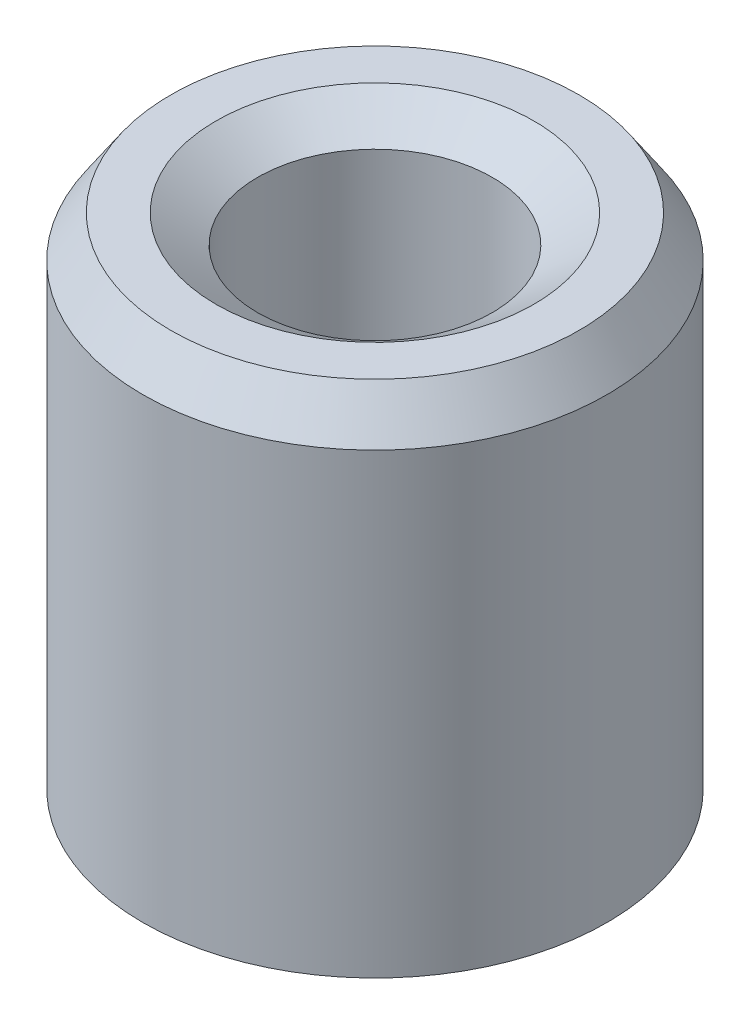
ISO-10303-21;
HEADER;
FILE_DESCRIPTION(('STEP AP214'),'2;1');
FILE_NAME('part.step','',(''),(''),'','','');
FILE_SCHEMA(('AUTOMOTIVE_DESIGN { 1 0 10303 214 1 1 1 1 }'));
ENDSEC;
DATA;
#1=APPLICATION_CONTEXT('core data for automotive mechanical design processes');
#2=APPLICATION_PROTOCOL_DEFINITION('international standard','automotive_design',2000,#1);
#3=PRODUCT_CONTEXT('',#1,'mechanical');
#4=PRODUCT('Part','Part','',(#3));
#5=PRODUCT_RELATED_PRODUCT_CATEGORY('part','',(#4));
#6=PRODUCT_DEFINITION_FORMATION('','',#4);
#7=PRODUCT_DEFINITION_CONTEXT('part definition',#1,'design');
#8=PRODUCT_DEFINITION('design','',#6,#7);
#9=PRODUCT_DEFINITION_SHAPE('','',#8);
#10=(LENGTH_UNIT() NAMED_UNIT(*) SI_UNIT(.MILLI.,.METRE.));
#11=(NAMED_UNIT(*) PLANE_ANGLE_UNIT() SI_UNIT($,.RADIAN.));
#12=(NAMED_UNIT(*) SI_UNIT($,.STERADIAN.) SOLID_ANGLE_UNIT());
#13=UNCERTAINTY_MEASURE_WITH_UNIT(LENGTH_MEASURE(1.E-05),#10,'distance_accuracy_value','');
#14=(GEOMETRIC_REPRESENTATION_CONTEXT(3) GLOBAL_UNCERTAINTY_ASSIGNED_CONTEXT((#13)) GLOBAL_UNIT_ASSIGNED_CONTEXT((#10,
#11,#12)) REPRESENTATION_CONTEXT('',''));
#15=CARTESIAN_POINT('',(0.,0.,0.));
#16=DIRECTION('',(0.,0.,1.));
#17=DIRECTION('',(1.,0.,0.));
#18=AXIS2_PLACEMENT_3D('',#15,#16,#17);
#19=CARTESIAN_POINT('',(0.,11.3471455715994,0.));
#20=DIRECTION('',(0.,-1.,0.));
#21=DIRECTION('',(0.,0.,-1.));
#22=AXIS2_PLACEMENT_3D('',#19,#20,#21);
#23=CYLINDRICAL_SURFACE('',#22,5.);
#24=CARTESIAN_POINT('',(0.,0.603669940585937,0.));
#25=DIRECTION('',(0.,1.,0.));
#26=DIRECTION('',(0.,0.,1.));
#27=AXIS2_PLACEMENT_3D('',#24,#25,#26);
#28=CIRCLE('',#27,5.);
#29=CARTESIAN_POINT('',(0.,0.603669940585937,5.));
#30=VERTEX_POINT('',#29);
#31=EDGE_CURVE('E10',#30,#30,#28,.T.);
#32=ORIENTED_EDGE('',*,*,#31,.T.);
#33=EDGE_LOOP('',(#32));
#34=FACE_BOUND('',#33,.T.);
#35=CARTESIAN_POINT('',(0.,10.451034548638,0.));
#36=DIRECTION('',(0.,1.,0.));
#37=DIRECTION('',(0.,0.,1.));
#38=AXIS2_PLACEMENT_3D('',#35,#36,#37);
#39=CIRCLE('',#38,5.);
#40=CARTESIAN_POINT('',(0.,10.451034548638,5.));
#41=VERTEX_POINT('',#40);
#42=EDGE_CURVE('E50',#41,#41,#39,.F.);
#43=ORIENTED_EDGE('',*,*,#42,.T.);
#44=EDGE_LOOP('',(#43));
#45=FACE_BOUND('',#44,.T.);
#46=ADVANCED_FACE('F39',(#34,#45),#23,.T.);
#47=CARTESIAN_POINT('',(0.,11.3471455715994,0.));
#48=DIRECTION('',(0.,1.,0.));
#49=DIRECTION('',(0.,0.,1.));
#50=AXIS2_PLACEMENT_3D('',#47,#48,#49);
#51=PLANE('',#50);
#52=CARTESIAN_POINT('',(0.,11.3471455715994,0.));
#53=DIRECTION('',(0.,1.,0.));
#54=DIRECTION('',(0.,0.,1.));
#55=AXIS2_PLACEMENT_3D('',#52,#53,#54);
#56=CIRCLE('',#55,3.42314823379089);
#57=CARTESIAN_POINT('',(0.,11.3471455715994,3.42314823379089));
#58=VERTEX_POINT('',#57);
#59=EDGE_CURVE('E58',#58,#58,#56,.F.);
#60=ORIENTED_EDGE('',*,*,#59,.T.);
#61=EDGE_LOOP('',(#60));
#62=FACE_BOUND('',#61,.T.);
#63=CARTESIAN_POINT('',(0.,11.3471455715994,0.));
#64=DIRECTION('',(0.,1.,0.));
#65=DIRECTION('',(0.,0.,1.));
#66=AXIS2_PLACEMENT_3D('',#63,#64,#65);
#67=CIRCLE('',#66,4.39633005941406);
#68=CARTESIAN_POINT('',(0.,11.3471455715994,4.39633005941406));
#69=VERTEX_POINT('',#68);
#70=EDGE_CURVE('E61',#69,#69,#67,.T.);
#71=ORIENTED_EDGE('',*,*,#70,.T.);
#72=EDGE_LOOP('',(#71));
#73=FACE_BOUND('',#72,.T.);
#74=ADVANCED_FACE('F88',(#62,#73),#51,.T.);
#75=CARTESIAN_POINT('',(0.,0.,0.));
#76=DIRECTION('',(0.,1.,0.));
#77=DIRECTION('',(0.,0.,1.));
#78=AXIS2_PLACEMENT_3D('',#75,#76,#77);
#79=PLANE('',#78);
#80=CARTESIAN_POINT('',(0.,0.,0.));
#81=DIRECTION('',(0.,1.,0.));
#82=DIRECTION('',(0.,0.,1.));
#83=AXIS2_PLACEMENT_3D('',#80,#81,#82);
#84=CIRCLE('',#83,3.13070715141538);
#85=CARTESIAN_POINT('',(0.,0.,3.13070715141538));
#86=VERTEX_POINT('',#85);
#87=EDGE_CURVE('E51',#86,#86,#84,.T.);
#88=ORIENTED_EDGE('',*,*,#87,.T.);
#89=EDGE_LOOP('',(#88));
#90=FACE_BOUND('',#89,.T.);
#91=CARTESIAN_POINT('',(0.,0.,0.));
#92=DIRECTION('',(0.,1.,0.));
#93=DIRECTION('',(0.,0.,1.));
#94=AXIS2_PLACEMENT_3D('',#91,#92,#93);
#95=CIRCLE('',#94,4.10388897703856);
#96=CARTESIAN_POINT('',(0.,0.,4.10388897703856));
#97=VERTEX_POINT('',#96);
#98=EDGE_CURVE('E54',#97,#97,#95,.F.);
#99=ORIENTED_EDGE('',*,*,#98,.T.);
#100=EDGE_LOOP('',(#99));
#101=FACE_BOUND('',#100,.T.);
#102=ADVANCED_FACE('F83',(#90,#101),#79,.F.);
#103=CARTESIAN_POINT('',(0.,11.3471455715994,0.));
#104=DIRECTION('',(0.,-1.,0.));
#105=DIRECTION('',(0.,0.,-1.));
#106=AXIS2_PLACEMENT_3D('',#103,#104,#105);
#107=CYLINDRICAL_SURFACE('',#106,2.52703721082945);
#108=CARTESIAN_POINT('',(0.,10.7434756310135,0.));
#109=DIRECTION('',(0.,1.,0.));
#110=DIRECTION('',(0.,0.,1.));
#111=AXIS2_PLACEMENT_3D('',#108,#109,#110);
#112=CIRCLE('',#111,2.52703721082945);
#113=CARTESIAN_POINT('',(0.,10.7434756310135,2.52703721082944));
#114=VERTEX_POINT('',#113);
#115=EDGE_CURVE('E67',#114,#114,#112,.T.);
#116=ORIENTED_EDGE('',*,*,#115,.T.);
#117=EDGE_LOOP('',(#116));
#118=FACE_BOUND('',#117,.T.);
#119=CARTESIAN_POINT('',(0.,0.896111022961436,0.));
#120=DIRECTION('',(0.,1.,0.));
#121=DIRECTION('',(0.,0.,1.));
#122=AXIS2_PLACEMENT_3D('',#119,#120,#121);
#123=CIRCLE('',#122,2.52703721082945);
#124=CARTESIAN_POINT('',(0.,0.896111022961436,2.52703721082945));
#125=VERTEX_POINT('',#124);
#126=EDGE_CURVE('E69',#125,#125,#123,.F.);
#127=ORIENTED_EDGE('',*,*,#126,.T.);
#128=EDGE_LOOP('',(#127));
#129=FACE_BOUND('',#128,.T.);
#130=ADVANCED_FACE('F71',(#118,#129),#107,.F.);
#131=CARTESIAN_POINT('',(0.,10.7434756310135,0.));
#132=DIRECTION('',(0.,1.,0.));
#133=DIRECTION('',(0.,0.,1.));
#134=AXIS2_PLACEMENT_3D('',#131,#132,#133);
#135=CONICAL_SURFACE('',#134,2.52703721082945,0.977971031399739);
#136=CARTESIAN_POINT('',(0.,11.3471455715994,3.42314823379089));
#137=CARTESIAN_POINT('',(0.,11.3408573430516,3.41381374396838));
#138=CARTESIAN_POINT('',(0.,11.3345691145039,3.40447925414586));
#139=CARTESIAN_POINT('',(0.,11.3219926574083,3.38581027450083));
#140=CARTESIAN_POINT('',(0.,11.3157044288606,3.37647578467832));
#141=CARTESIAN_POINT('',(0.,11.303127971765,3.35780680503329));
#142=CARTESIAN_POINT('',(0.,11.2968397432172,3.34847231521077));
#143=CARTESIAN_POINT('',(0.,11.2842632861217,3.32980333556574));
#144=CARTESIAN_POINT('',(0.,11.2779750575739,3.32046884574323));
#145=CARTESIAN_POINT('',(0.,11.2653986004784,3.3017998660982));
#146=CARTESIAN_POINT('',(0.,11.2591103719306,3.29246537627568));
#147=CARTESIAN_POINT('',(0.,11.2465339148351,3.27379639663065));
#148=CARTESIAN_POINT('',(0.,11.2402456862873,3.26446190680813));
#149=CARTESIAN_POINT('',(0.,11.2276692291918,3.2457929271631));
#150=CARTESIAN_POINT('',(0.,11.221381000644,3.23645843734059));
#151=CARTESIAN_POINT('',(0.,11.2088045435485,3.21778945769556));
#152=CARTESIAN_POINT('',(0.,11.2025163150007,3.20845496787304));
#153=CARTESIAN_POINT('',(0.,11.1899398579051,3.18978598822801));
#154=CARTESIAN_POINT('',(0.,11.1836516293574,3.1804514984055));
#155=CARTESIAN_POINT('',(0.,11.1710751722618,3.16178251876047));
#156=CARTESIAN_POINT('',(0.,11.1647869437141,3.15244802893795));
#157=CARTESIAN_POINT('',(0.,11.1522104866185,3.13377904929292));
#158=CARTESIAN_POINT('',(0.,11.1459222580708,3.12444455947041));
#159=CARTESIAN_POINT('',(0.,11.1333458009752,3.10577557982538));
#160=CARTESIAN_POINT('',(0.,11.1270575724274,3.09644109000286));
#161=CARTESIAN_POINT('',(0.,11.1144811153319,3.07777211035783));
#162=CARTESIAN_POINT('',(0.,11.1081928867841,3.06843762053532));
#163=CARTESIAN_POINT('',(0.,11.0956164296886,3.04976864089029));
#164=CARTESIAN_POINT('',(0.,11.0893282011408,3.04043415106777));
#165=CARTESIAN_POINT('',(0.,11.0767517440453,3.02176517142274));
#166=CARTESIAN_POINT('',(0.,11.0704635154975,3.01243068160023));
#167=CARTESIAN_POINT('',(0.,11.057887058402,2.9937617019552));
#168=CARTESIAN_POINT('',(0.,11.0515988298542,2.98442721213268));
#169=CARTESIAN_POINT('',(0.,11.0390223727587,2.96575823248765));
#170=CARTESIAN_POINT('',(0.,11.0327341442109,2.95642374266514));
#171=CARTESIAN_POINT('',(0.,11.0201576871154,2.93775476302011));
#172=CARTESIAN_POINT('',(0.,11.0138694585676,2.92842027319759));
#173=CARTESIAN_POINT('',(0.,11.001293001472,2.90975129355256));
#174=CARTESIAN_POINT('',(0.,10.9950047729243,2.90041680373005));
#175=CARTESIAN_POINT('',(0.,10.9824283158287,2.88174782408502));
#176=CARTESIAN_POINT('',(0.,10.976140087281,2.8724133342625));
#177=CARTESIAN_POINT('',(0.,10.9635636301854,2.85374435461747));
#178=CARTESIAN_POINT('',(0.,10.9572754016376,2.84440986479496));
#179=CARTESIAN_POINT('',(0.,10.9446989445421,2.82574088514993));
#180=CARTESIAN_POINT('',(0.,10.9384107159943,2.81640639532741));
#181=CARTESIAN_POINT('',(0.,10.9258342588988,2.79773741568238));
#182=CARTESIAN_POINT('',(0.,10.919546030351,2.78840292585987));
#183=CARTESIAN_POINT('',(0.,10.9069695732555,2.76973394621484));
#184=CARTESIAN_POINT('',(0.,10.9006813447077,2.76039945639232));
#185=CARTESIAN_POINT('',(0.,10.8881048876122,2.74173047674729));
#186=CARTESIAN_POINT('',(0.,10.8818166590644,2.73239598692478));
#187=CARTESIAN_POINT('',(0.,10.8692402019689,2.71372700727975));
#188=CARTESIAN_POINT('',(0.,10.8629519734211,2.70439251745723));
#189=CARTESIAN_POINT('',(0.,10.8503755163256,2.6857235378122));
#190=CARTESIAN_POINT('',(0.,10.8440872877778,2.67638904798969));
#191=CARTESIAN_POINT('',(0.,10.8315108306822,2.65772006834465));
#192=CARTESIAN_POINT('',(0.,10.8252226021345,2.64838557852214));
#193=CARTESIAN_POINT('',(0.,10.8126461450389,2.62971659887711));
#194=CARTESIAN_POINT('',(0.,10.8063579164912,2.62038210905459));
#195=CARTESIAN_POINT('',(0.,10.7937814593956,2.60171312940956));
#196=CARTESIAN_POINT('',(0.,10.7874932308479,2.59237863958705));
#197=CARTESIAN_POINT('',(0.,10.7749167737523,2.57370965994202));
#198=CARTESIAN_POINT('',(0.,10.7686285452045,2.5643751701195));
#199=CARTESIAN_POINT('',(0.,10.756052088109,2.54570619047447));
#200=CARTESIAN_POINT('',(0.,10.7497638595612,2.53637170065196));
#201=CARTESIAN_POINT('',(0.,10.7434756310135,2.52703721082944));
#202=B_SPLINE_CURVE_WITH_KNOTS('',3,(#136,#137,#138,#139,#140,#141,#142,#143,#144,#145,#146,
#147,#148,#149,#150,#151,#152,#153,#154,#155,#156,#157,#158,#159,#160,#161,#162,#163,#164,#165,
#166,#167,#168,#169,#170,#171,#172,#173,#174,#175,#176,#177,#178,#179,#180,#181,#182,#183,#184,
#185,#186,#187,#188,#189,#190,#191,#192,#193,#194,#195,#196,#197,#198,#199,#200,#201),
.UNSPECIFIED.,.F.,.F.,(4,2,2,2,2,2,2,2,2,2,2,2,2,2,2,2,2,2,2,2,2,2,2,2,2,2,2,2,2,2,2,2,4),(0.,
0.0337649324986832,0.0675298649973674,0.101294797496051,0.135059729994735,0.168824662493418,
0.202589594992102,0.236354527490786,0.27011945998947,0.303884392488153,0.337649324986837,
0.371414257485521,0.405179189984205,0.438944122482888,0.472709054981573,0.506473987480256,
0.54023891997894,0.574003852477623,0.607768784976308,0.641533717474991,0.675298649973675,
0.709063582472359,0.742828514971043,0.776593447469726,0.810358379968411,0.844123312467094,
0.877888244965778,0.911653177464462,0.945418109963146,0.979183042461829,1.01294797496051,
1.0467129074592,1.08047783995788),.UNSPECIFIED.);
#203=EDGE_CURVE('BSEAM77',#58,#114,#202,.T.);
#204=ORIENTED_EDGE('',*,*,#59,.F.);
#205=ORIENTED_EDGE('',*,*,#115,.F.);
#206=ORIENTED_EDGE('',*,*,#203,.T.);
#207=ORIENTED_EDGE('',*,*,#203,.F.);
#208=EDGE_LOOP('',(#204,#206,#205,#207));
#209=FACE_BOUND('',#208,.T.);
#210=ADVANCED_FACE('F77',(#209),#135,.F.);
#211=CARTESIAN_POINT('',(0.,0.,0.));
#212=DIRECTION('',(0.,-1.,0.));
#213=DIRECTION('',(0.,0.,-1.));
#214=AXIS2_PLACEMENT_3D('',#211,#212,#213);
#215=CONICAL_SURFACE('',#214,3.13070715141538,0.592825295395159);
#216=ORIENTED_EDGE('',*,*,#126,.F.);
#217=EDGE_LOOP('',(#216));
#218=FACE_BOUND('',#217,.T.);
#219=ORIENTED_EDGE('',*,*,#87,.F.);
#220=EDGE_LOOP('',(#219));
#221=FACE_BOUND('',#220,.T.);
#222=ADVANCED_FACE('F73',(#218,#221),#215,.F.);
#223=CARTESIAN_POINT('',(0.,0.603669940585937,0.));
#224=DIRECTION('',(0.,1.,0.));
#225=DIRECTION('',(0.,0.,1.));
#226=AXIS2_PLACEMENT_3D('',#223,#224,#225);
#227=CONICAL_SURFACE('',#226,5.,0.977971031399739);
#228=ORIENTED_EDGE('',*,*,#98,.F.);
#229=EDGE_LOOP('',(#228));
#230=FACE_BOUND('',#229,.T.);
#231=ORIENTED_EDGE('',*,*,#31,.F.);
#232=EDGE_LOOP('',(#231));
#233=FACE_BOUND('',#232,.T.);
#234=ADVANCED_FACE('F76',(#230,#233),#227,.T.);
#235=CARTESIAN_POINT('',(0.,11.3471455715994,0.));
#236=DIRECTION('',(0.,-1.,0.));
#237=DIRECTION('',(0.,0.,-1.));
#238=AXIS2_PLACEMENT_3D('',#235,#236,#237);
#239=CONICAL_SURFACE('',#238,4.39633005941406,0.592825295395158);
#240=ORIENTED_EDGE('',*,*,#42,.F.);
#241=EDGE_LOOP('',(#240));
#242=FACE_BOUND('',#241,.T.);
#243=ORIENTED_EDGE('',*,*,#70,.F.);
#244=EDGE_LOOP('',(#243));
#245=FACE_BOUND('',#244,.T.);
#246=ADVANCED_FACE('F45',(#242,#245),#239,.T.);
#247=CLOSED_SHELL('',(#46,#74,#102,#130,#210,#222,#234,#246));
#248=MANIFOLD_SOLID_BREP('B2',#247);
#249=ADVANCED_BREP_SHAPE_REPRESENTATION('',(#18,#248),#14);
#250=SHAPE_DEFINITION_REPRESENTATION(#9,#249);
ENDSEC;
END-ISO-10303-21;
